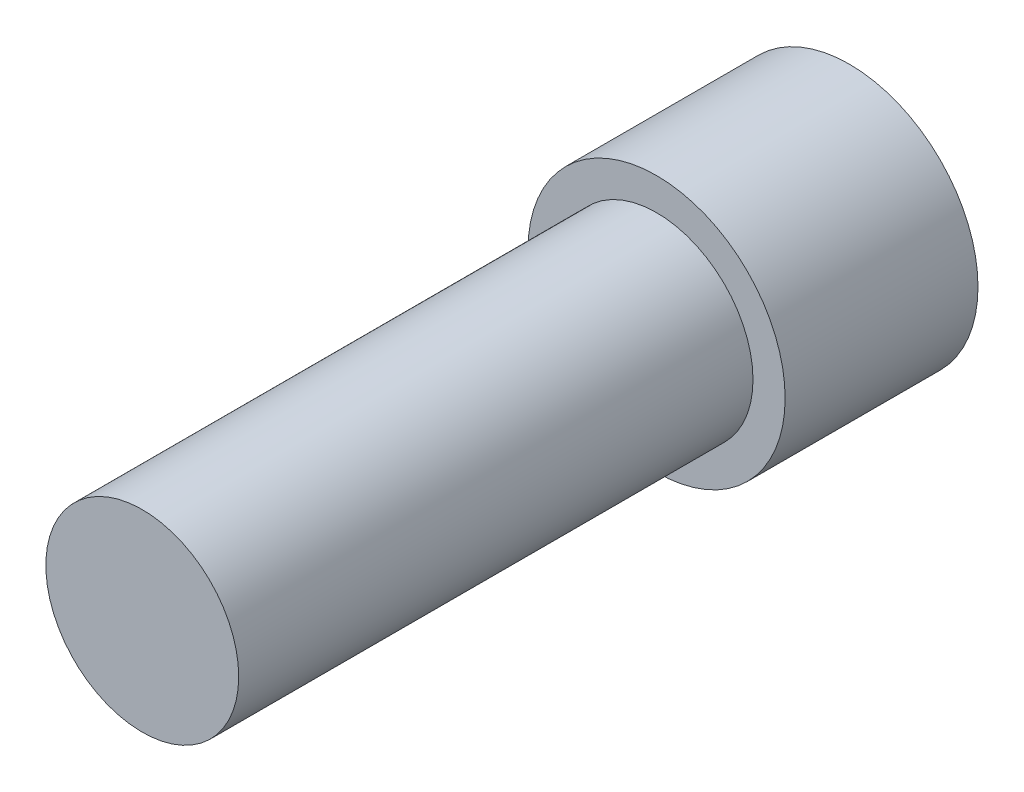
ISO-10303-21;
HEADER;
FILE_DESCRIPTION(('STEP AP214'),'2;1');
FILE_NAME('part.step','',(''),(''),'','','');
FILE_SCHEMA(('AUTOMOTIVE_DESIGN { 1 0 10303 214 1 1 1 1 }'));
ENDSEC;
DATA;
#1=APPLICATION_CONTEXT('core data for automotive mechanical design processes');
#2=APPLICATION_PROTOCOL_DEFINITION('international standard','automotive_design',2000,#1);
#3=PRODUCT_CONTEXT('',#1,'mechanical');
#4=PRODUCT('Part','Part','',(#3));
#5=PRODUCT_RELATED_PRODUCT_CATEGORY('part','',(#4));
#6=PRODUCT_DEFINITION_FORMATION('','',#4);
#7=PRODUCT_DEFINITION_CONTEXT('part definition',#1,'design');
#8=PRODUCT_DEFINITION('design','',#6,#7);
#9=PRODUCT_DEFINITION_SHAPE('','',#8);
#10=(LENGTH_UNIT() NAMED_UNIT(*) SI_UNIT(.MILLI.,.METRE.));
#11=(NAMED_UNIT(*) PLANE_ANGLE_UNIT() SI_UNIT($,.RADIAN.));
#12=(NAMED_UNIT(*) SI_UNIT($,.STERADIAN.) SOLID_ANGLE_UNIT());
#13=UNCERTAINTY_MEASURE_WITH_UNIT(LENGTH_MEASURE(1.E-05),#10,'distance_accuracy_value','');
#14=(GEOMETRIC_REPRESENTATION_CONTEXT(3) GLOBAL_UNCERTAINTY_ASSIGNED_CONTEXT((#13)) GLOBAL_UNIT_ASSIGNED_CONTEXT((#10,
#11,#12)) REPRESENTATION_CONTEXT('',''));
#15=CARTESIAN_POINT('',(0.,0.,0.));
#16=DIRECTION('',(0.,0.,1.));
#17=DIRECTION('',(1.,0.,0.));
#18=AXIS2_PLACEMENT_3D('',#15,#16,#17);
#19=CARTESIAN_POINT('',(0.,0.,3.));
#20=DIRECTION('',(0.,0.,-1.));
#21=DIRECTION('',(-1.,0.,0.));
#22=AXIS2_PLACEMENT_3D('',#19,#20,#21);
#23=CYLINDRICAL_SURFACE('',#22,2.);
#24=CARTESIAN_POINT('',(0.,0.,3.));
#25=DIRECTION('',(0.,0.,1.));
#26=DIRECTION('',(1.,0.,0.));
#27=AXIS2_PLACEMENT_3D('',#24,#25,#26);
#28=CIRCLE('',#27,2.);
#29=CARTESIAN_POINT('',(2.,0.,3.));
#30=VERTEX_POINT('',#29);
#31=EDGE_CURVE('E11',#30,#30,#28,.T.);
#32=ORIENTED_EDGE('',*,*,#31,.F.);
#33=EDGE_LOOP('',(#32));
#34=FACE_BOUND('',#33,.T.);
#35=CARTESIAN_POINT('',(0.,0.,0.));
#36=DIRECTION('',(0.,0.,1.));
#37=DIRECTION('',(1.,0.,0.));
#38=AXIS2_PLACEMENT_3D('',#35,#36,#37);
#39=CIRCLE('',#38,2.);
#40=CARTESIAN_POINT('',(2.,0.,0.));
#41=VERTEX_POINT('',#40);
#42=EDGE_CURVE('E37',#41,#41,#39,.T.);
#43=ORIENTED_EDGE('',*,*,#42,.T.);
#44=EDGE_LOOP('',(#43));
#45=FACE_BOUND('',#44,.T.);
#46=ADVANCED_FACE('F34',(#34,#45),#23,.T.);
#47=CARTESIAN_POINT('',(0.,0.,3.));
#48=DIRECTION('',(0.,0.,1.));
#49=DIRECTION('',(1.,0.,0.));
#50=AXIS2_PLACEMENT_3D('',#47,#48,#49);
#51=PLANE('',#50);
#52=CARTESIAN_POINT('',(0.,0.,3.));
#53=DIRECTION('',(0.,0.,1.));
#54=DIRECTION('',(1.,0.,0.));
#55=AXIS2_PLACEMENT_3D('',#52,#53,#54);
#56=CIRCLE('',#55,1.5);
#57=CARTESIAN_POINT('',(1.5,0.,3.));
#58=VERTEX_POINT('',#57);
#59=EDGE_CURVE('E135',#58,#58,#56,.T.);
#60=ORIENTED_EDGE('',*,*,#59,.F.);
#61=EDGE_LOOP('',(#60));
#62=FACE_BOUND('',#61,.T.);
#63=ORIENTED_EDGE('',*,*,#31,.T.);
#64=EDGE_LOOP('',(#63));
#65=FACE_BOUND('',#64,.T.);
#66=ADVANCED_FACE('F149',(#62,#65),#51,.T.);
#67=CARTESIAN_POINT('',(0.,0.,0.));
#68=DIRECTION('',(0.,0.,1.));
#69=DIRECTION('',(1.,0.,0.));
#70=AXIS2_PLACEMENT_3D('',#67,#68,#69);
#71=PLANE('',#70);
#72=DIRECTION('',(0.0162359142624325,0.999868188856943,0.));
#73=VECTOR('',#72,1.);
#74=CARTESIAN_POINT('',(-1.51386299749035,-0.8415573805924,0.));
#75=LINE('',#74,#73);
#76=CARTESIAN_POINT('',(-1.51386299749035,-0.8415573805924,0.));
#77=VERTEX_POINT('',#76);
#78=CARTESIAN_POINT('',(-1.48574156908048,0.890265123379698,0.));
#79=VERTEX_POINT('',#78);
#80=EDGE_CURVE('E122',#77,#79,#75,.T.);
#81=ORIENTED_EDGE('',*,*,#80,.F.);
#82=DIRECTION('',(-0.857793294854833,0.513994808633405,0.));
#83=VECTOR('',#82,1.);
#84=CARTESIAN_POINT('',(-0.0281214284098656,-1.7318225039721,0.));
#85=LINE('',#84,#83);
#86=CARTESIAN_POINT('',(-0.0281214284098656,-1.7318225039721,0.));
#87=VERTEX_POINT('',#86);
#88=EDGE_CURVE('E48',#87,#77,#85,.T.);
#89=ORIENTED_EDGE('',*,*,#88,.F.);
#90=DIRECTION('',(-0.874029209117265,-0.485873380223539,0.));
#91=VECTOR('',#90,1.);
#92=CARTESIAN_POINT('',(1.48574156908048,-0.890265123379698,0.));
#93=LINE('',#92,#91);
#94=CARTESIAN_POINT('',(1.48574156908048,-0.890265123379698,0.));
#95=VERTEX_POINT('',#94);
#96=EDGE_CURVE('E131',#95,#87,#93,.T.);
#97=ORIENTED_EDGE('',*,*,#96,.F.);
#98=DIRECTION('',(-0.0162359142624327,-0.999868188856943,0.));
#99=VECTOR('',#98,1.);
#100=CARTESIAN_POINT('',(1.51386299749035,0.8415573805924,0.));
#101=LINE('',#100,#99);
#102=CARTESIAN_POINT('',(1.51386299749035,0.8415573805924,0.));
#103=VERTEX_POINT('',#102);
#104=EDGE_CURVE('E129',#103,#95,#101,.T.);
#105=ORIENTED_EDGE('',*,*,#104,.F.);
#106=DIRECTION('',(0.857793294854833,-0.513994808633404,0.));
#107=VECTOR('',#106,1.);
#108=CARTESIAN_POINT('',(0.0281214284098654,1.7318225039721,0.));
#109=LINE('',#108,#107);
#110=CARTESIAN_POINT('',(0.0281214284098654,1.7318225039721,0.));
#111=VERTEX_POINT('',#110);
#112=EDGE_CURVE('E96',#111,#103,#109,.T.);
#113=ORIENTED_EDGE('',*,*,#112,.F.);
#114=DIRECTION('',(0.874029209117265,0.485873380223539,0.));
#115=VECTOR('',#114,1.);
#116=CARTESIAN_POINT('',(-1.48574156908048,0.890265123379698,0.));
#117=LINE('',#116,#115);
#118=EDGE_CURVE('E125',#79,#111,#117,.T.);
#119=ORIENTED_EDGE('',*,*,#118,.F.);
#120=EDGE_LOOP('',(#81,#89,#97,#105,#113,#119));
#121=FACE_BOUND('',#120,.T.);
#122=ORIENTED_EDGE('',*,*,#42,.F.);
#123=EDGE_LOOP('',(#122));
#124=FACE_BOUND('',#123,.T.);
#125=ADVANCED_FACE('F152',(#121,#124),#71,.F.);
#126=CARTESIAN_POINT('',(0.,0.,11.));
#127=DIRECTION('',(0.,0.,-1.));
#128=DIRECTION('',(-1.,0.,0.));
#129=AXIS2_PLACEMENT_3D('',#126,#127,#128);
#130=CYLINDRICAL_SURFACE('',#129,1.5);
#131=CARTESIAN_POINT('',(0.,0.,11.));
#132=DIRECTION('',(0.,0.,1.));
#133=DIRECTION('',(1.,0.,0.));
#134=AXIS2_PLACEMENT_3D('',#131,#132,#133);
#135=CIRCLE('',#134,1.5);
#136=CARTESIAN_POINT('',(1.5,0.,11.));
#137=VERTEX_POINT('',#136);
#138=EDGE_CURVE('E141',#137,#137,#135,.T.);
#139=ORIENTED_EDGE('',*,*,#138,.F.);
#140=EDGE_LOOP('',(#139));
#141=FACE_BOUND('',#140,.T.);
#142=ORIENTED_EDGE('',*,*,#59,.T.);
#143=EDGE_LOOP('',(#142));
#144=FACE_BOUND('',#143,.T.);
#145=ADVANCED_FACE('F147',(#141,#144),#130,.T.);
#146=CARTESIAN_POINT('',(0.,0.,11.));
#147=DIRECTION('',(0.,0.,1.));
#148=DIRECTION('',(1.,0.,0.));
#149=AXIS2_PLACEMENT_3D('',#146,#147,#148);
#150=PLANE('',#149);
#151=ORIENTED_EDGE('',*,*,#138,.T.);
#152=EDGE_LOOP('',(#151));
#153=FACE_BOUND('',#152,.T.);
#154=ADVANCED_FACE('F166',(#153),#150,.T.);
#155=CARTESIAN_POINT('',(-0.0281214284098656,-1.7318225039721,2.));
#156=DIRECTION('',(-0.513994808633405,-0.857793294854833,0.));
#157=DIRECTION('',(0.857793294854833,-0.513994808633405,0.));
#158=AXIS2_PLACEMENT_3D('',#155,#156,#157);
#159=PLANE('',#158);
#160=ORIENTED_EDGE('',*,*,#88,.T.);
#161=DIRECTION('',(0.,0.,-1.));
#162=VECTOR('',#161,1.);
#163=CARTESIAN_POINT('',(-1.51386299749035,-0.8415573805924,2.));
#164=LINE('',#163,#162);
#165=CARTESIAN_POINT('',(-1.51386299749035,-0.8415573805924,2.));
#166=VERTEX_POINT('',#165);
#167=EDGE_CURVE('E78',#166,#77,#164,.T.);
#168=ORIENTED_EDGE('',*,*,#167,.F.);
#169=DIRECTION('',(-0.857793294854833,0.513994808633405,0.));
#170=VECTOR('',#169,1.);
#171=CARTESIAN_POINT('',(-0.0281214284098656,-1.7318225039721,2.));
#172=LINE('',#171,#170);
#173=CARTESIAN_POINT('',(-0.0281214284098656,-1.7318225039721,2.));
#174=VERTEX_POINT('',#173);
#175=EDGE_CURVE('E133',#174,#166,#172,.T.);
#176=ORIENTED_EDGE('',*,*,#175,.F.);
#177=DIRECTION('',(0.,0.,-1.));
#178=VECTOR('',#177,1.);
#179=CARTESIAN_POINT('',(-0.0281214284098656,-1.7318225039721,2.));
#180=LINE('',#179,#178);
#181=EDGE_CURVE('E56',#174,#87,#180,.T.);
#182=ORIENTED_EDGE('',*,*,#181,.T.);
#183=EDGE_LOOP('',(#160,#168,#176,#182));
#184=FACE_BOUND('',#183,.T.);
#185=ADVANCED_FACE('F173',(#184),#159,.F.);
#186=CARTESIAN_POINT('',(1.48574156908048,-0.890265123379698,2.));
#187=DIRECTION('',(0.485873380223539,-0.874029209117265,0.));
#188=DIRECTION('',(0.874029209117265,0.485873380223539,0.));
#189=AXIS2_PLACEMENT_3D('',#186,#187,#188);
#190=PLANE('',#189);
#191=ORIENTED_EDGE('',*,*,#96,.T.);
#192=ORIENTED_EDGE('',*,*,#181,.F.);
#193=DIRECTION('',(-0.874029209117265,-0.485873380223539,0.));
#194=VECTOR('',#193,1.);
#195=CARTESIAN_POINT('',(1.48574156908048,-0.890265123379698,2.));
#196=LINE('',#195,#194);
#197=CARTESIAN_POINT('',(1.48574156908048,-0.890265123379698,2.));
#198=VERTEX_POINT('',#197);
#199=EDGE_CURVE('E108',#198,#174,#196,.T.);
#200=ORIENTED_EDGE('',*,*,#199,.F.);
#201=DIRECTION('',(0.,0.,-1.));
#202=VECTOR('',#201,1.);
#203=CARTESIAN_POINT('',(1.48574156908048,-0.890265123379698,2.));
#204=LINE('',#203,#202);
#205=EDGE_CURVE('E100',#198,#95,#204,.T.);
#206=ORIENTED_EDGE('',*,*,#205,.T.);
#207=EDGE_LOOP('',(#191,#192,#200,#206));
#208=FACE_BOUND('',#207,.T.);
#209=ADVANCED_FACE('F177',(#208),#190,.F.);
#210=CARTESIAN_POINT('',(1.51386299749035,0.8415573805924,2.));
#211=DIRECTION('',(0.999868188856943,-0.0162359142624327,0.));
#212=DIRECTION('',(0.0162359142624327,0.999868188856943,0.));
#213=AXIS2_PLACEMENT_3D('',#210,#211,#212);
#214=PLANE('',#213);
#215=ORIENTED_EDGE('',*,*,#104,.T.);
#216=ORIENTED_EDGE('',*,*,#205,.F.);
#217=DIRECTION('',(-0.0162359142624327,-0.999868188856943,0.));
#218=VECTOR('',#217,1.);
#219=CARTESIAN_POINT('',(1.51386299749035,0.8415573805924,2.));
#220=LINE('',#219,#218);
#221=CARTESIAN_POINT('',(1.51386299749035,0.8415573805924,2.));
#222=VERTEX_POINT('',#221);
#223=EDGE_CURVE('E104',#222,#198,#220,.T.);
#224=ORIENTED_EDGE('',*,*,#223,.F.);
#225=DIRECTION('',(0.,0.,-1.));
#226=VECTOR('',#225,1.);
#227=CARTESIAN_POINT('',(1.51386299749035,0.8415573805924,2.));
#228=LINE('',#227,#226);
#229=EDGE_CURVE('E89',#222,#103,#228,.T.);
#230=ORIENTED_EDGE('',*,*,#229,.T.);
#231=EDGE_LOOP('',(#215,#216,#224,#230));
#232=FACE_BOUND('',#231,.T.);
#233=ADVANCED_FACE('F105',(#232),#214,.F.);
#234=CARTESIAN_POINT('',(0.0281214284098654,1.7318225039721,2.));
#235=DIRECTION('',(0.513994808633404,0.857793294854833,0.));
#236=DIRECTION('',(-0.857793294854833,0.513994808633404,0.));
#237=AXIS2_PLACEMENT_3D('',#234,#235,#236);
#238=PLANE('',#237);
#239=ORIENTED_EDGE('',*,*,#112,.T.);
#240=ORIENTED_EDGE('',*,*,#229,.F.);
#241=DIRECTION('',(0.857793294854833,-0.513994808633404,0.));
#242=VECTOR('',#241,1.);
#243=CARTESIAN_POINT('',(0.0281214284098654,1.7318225039721,2.));
#244=LINE('',#243,#242);
#245=CARTESIAN_POINT('',(0.0281214284098654,1.7318225039721,2.));
#246=VERTEX_POINT('',#245);
#247=EDGE_CURVE('E93',#246,#222,#244,.T.);
#248=ORIENTED_EDGE('',*,*,#247,.F.);
#249=DIRECTION('',(0.,0.,-1.));
#250=VECTOR('',#249,1.);
#251=CARTESIAN_POINT('',(0.0281214284098654,1.7318225039721,2.));
#252=LINE('',#251,#250);
#253=EDGE_CURVE('E101',#246,#111,#252,.T.);
#254=ORIENTED_EDGE('',*,*,#253,.T.);
#255=EDGE_LOOP('',(#239,#240,#248,#254));
#256=FACE_BOUND('',#255,.T.);
#257=ADVANCED_FACE('F91',(#256),#238,.F.);
#258=CARTESIAN_POINT('',(-1.48574156908048,0.890265123379698,2.));
#259=DIRECTION('',(-0.485873380223539,0.874029209117266,0.));
#260=DIRECTION('',(-0.874029209117266,-0.485873380223539,0.));
#261=AXIS2_PLACEMENT_3D('',#258,#259,#260);
#262=PLANE('',#261);
#263=ORIENTED_EDGE('',*,*,#118,.T.);
#264=ORIENTED_EDGE('',*,*,#253,.F.);
#265=DIRECTION('',(0.874029209117265,0.485873380223539,0.));
#266=VECTOR('',#265,1.);
#267=CARTESIAN_POINT('',(-1.48574156908048,0.890265123379698,2.));
#268=LINE('',#267,#266);
#269=CARTESIAN_POINT('',(-1.48574156908048,0.890265123379698,2.));
#270=VERTEX_POINT('',#269);
#271=EDGE_CURVE('E114',#270,#246,#268,.T.);
#272=ORIENTED_EDGE('',*,*,#271,.F.);
#273=DIRECTION('',(0.,0.,-1.));
#274=VECTOR('',#273,1.);
#275=CARTESIAN_POINT('',(-1.48574156908048,0.890265123379698,2.));
#276=LINE('',#275,#274);
#277=EDGE_CURVE('E138',#270,#79,#276,.T.);
#278=ORIENTED_EDGE('',*,*,#277,.T.);
#279=EDGE_LOOP('',(#263,#264,#272,#278));
#280=FACE_BOUND('',#279,.T.);
#281=ADVANCED_FACE('F181',(#280),#262,.F.);
#282=CARTESIAN_POINT('',(-1.51386299749035,-0.8415573805924,2.));
#283=DIRECTION('',(-0.999868188856943,0.0162359142624325,0.));
#284=DIRECTION('',(-0.0162359142624325,-0.999868188856943,0.));
#285=AXIS2_PLACEMENT_3D('',#282,#283,#284);
#286=PLANE('',#285);
#287=ORIENTED_EDGE('',*,*,#80,.T.);
#288=ORIENTED_EDGE('',*,*,#277,.F.);
#289=DIRECTION('',(0.0162359142624325,0.999868188856943,0.));
#290=VECTOR('',#289,1.);
#291=CARTESIAN_POINT('',(-1.51386299749035,-0.8415573805924,2.));
#292=LINE('',#291,#290);
#293=EDGE_CURVE('E116',#166,#270,#292,.T.);
#294=ORIENTED_EDGE('',*,*,#293,.F.);
#295=ORIENTED_EDGE('',*,*,#167,.T.);
#296=EDGE_LOOP('',(#287,#288,#294,#295));
#297=FACE_BOUND('',#296,.T.);
#298=ADVANCED_FACE('F178',(#297),#286,.F.);
#299=CARTESIAN_POINT('',(0.,0.,2.));
#300=DIRECTION('',(0.,0.,-1.));
#301=DIRECTION('',(-1.,0.,0.));
#302=AXIS2_PLACEMENT_3D('',#299,#300,#301);
#303=PLANE('',#302);
#304=ORIENTED_EDGE('',*,*,#175,.T.);
#305=ORIENTED_EDGE('',*,*,#293,.T.);
#306=ORIENTED_EDGE('',*,*,#271,.T.);
#307=ORIENTED_EDGE('',*,*,#247,.T.);
#308=ORIENTED_EDGE('',*,*,#223,.T.);
#309=ORIENTED_EDGE('',*,*,#199,.T.);
#310=EDGE_LOOP('',(#304,#305,#306,#307,#308,#309));
#311=FACE_BOUND('',#310,.T.);
#312=ADVANCED_FACE('F111',(#311),#303,.T.);
#313=CLOSED_SHELL('',(#46,#66,#125,#145,#154,#185,#209,#233,#257,#281,#298,#312));
#314=MANIFOLD_SOLID_BREP('B2',#313);
#315=ADVANCED_BREP_SHAPE_REPRESENTATION('',(#18,#314),#14);
#316=SHAPE_DEFINITION_REPRESENTATION(#9,#315);
ENDSEC;
END-ISO-10303-21;
